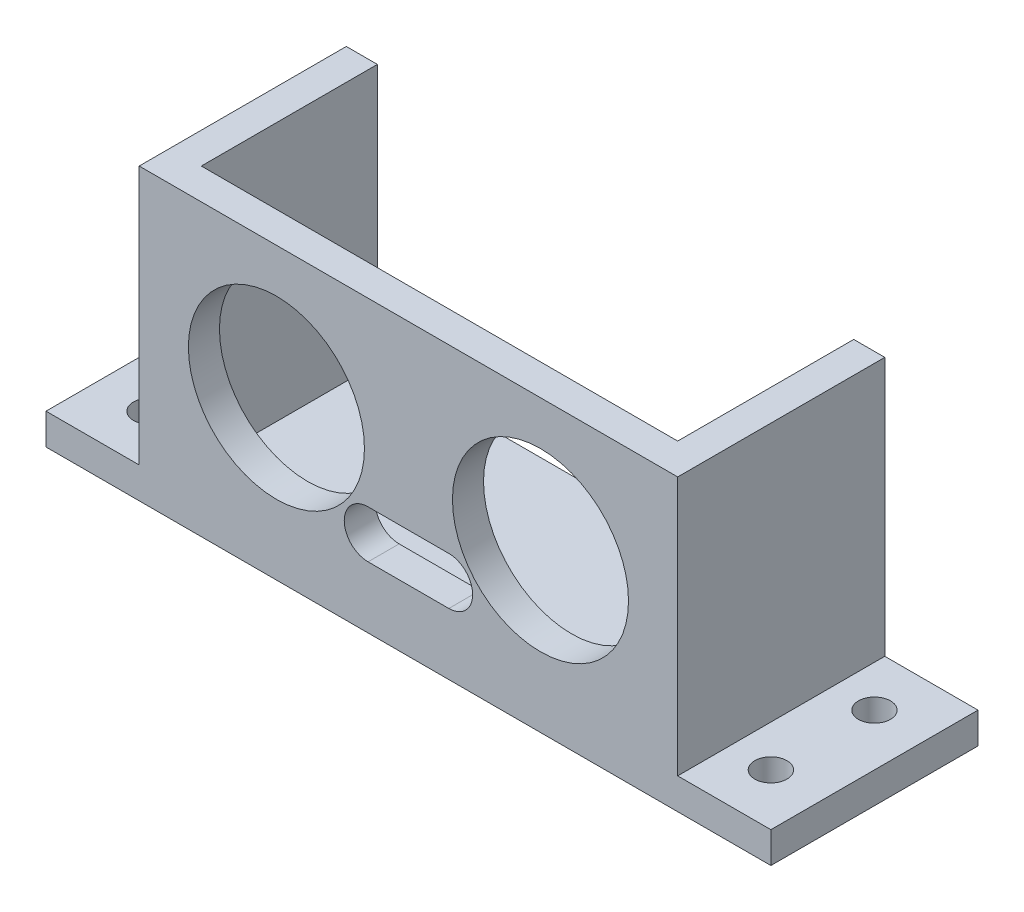
ISO-10303-21;
HEADER;
FILE_DESCRIPTION(('STEP AP214'),'2;1');
FILE_NAME('part.step','',(''),(''),'','','');
FILE_SCHEMA(('AUTOMOTIVE_DESIGN { 1 0 10303 214 1 1 1 1 }'));
ENDSEC;
DATA;
#1=APPLICATION_CONTEXT('core data for automotive mechanical design processes');
#2=APPLICATION_PROTOCOL_DEFINITION('international standard','automotive_design',2000,#1);
#3=PRODUCT_CONTEXT('',#1,'mechanical');
#4=PRODUCT('Part','Part','',(#3));
#5=PRODUCT_RELATED_PRODUCT_CATEGORY('part','',(#4));
#6=PRODUCT_DEFINITION_FORMATION('','',#4);
#7=PRODUCT_DEFINITION_CONTEXT('part definition',#1,'design');
#8=PRODUCT_DEFINITION('design','',#6,#7);
#9=PRODUCT_DEFINITION_SHAPE('','',#8);
#10=(LENGTH_UNIT() NAMED_UNIT(*) SI_UNIT(.MILLI.,.METRE.));
#11=(NAMED_UNIT(*) PLANE_ANGLE_UNIT() SI_UNIT($,.RADIAN.));
#12=(NAMED_UNIT(*) SI_UNIT($,.STERADIAN.) SOLID_ANGLE_UNIT());
#13=UNCERTAINTY_MEASURE_WITH_UNIT(LENGTH_MEASURE(1.E-05),#10,'distance_accuracy_value','');
#14=(GEOMETRIC_REPRESENTATION_CONTEXT(3) GLOBAL_UNCERTAINTY_ASSIGNED_CONTEXT((#13)) GLOBAL_UNIT_ASSIGNED_CONTEXT((#10,
#11,#12)) REPRESENTATION_CONTEXT('',''));
#15=CARTESIAN_POINT('',(0.,0.,0.));
#16=DIRECTION('',(0.,0.,1.));
#17=DIRECTION('',(1.,0.,0.));
#18=AXIS2_PLACEMENT_3D('',#15,#16,#17);
#19=CARTESIAN_POINT('',(0.,3.,0.));
#20=DIRECTION('',(0.,-1.,0.));
#21=DIRECTION('',(0.,0.,-1.));
#22=AXIS2_PLACEMENT_3D('',#19,#20,#21);
#23=PLANE('',#22);
#24=CARTESIAN_POINT('',(-30.,3.,-5.));
#25=DIRECTION('',(0.,1.,0.));
#26=DIRECTION('',(0.,0.,-1.));
#27=AXIS2_PLACEMENT_3D('',#24,#25,#26);
#28=CIRCLE('',#27,1.55);
#29=CARTESIAN_POINT('',(-30.,3.,-6.55));
#30=VERTEX_POINT('',#29);
#31=EDGE_CURVE('E291',#30,#30,#28,.T.);
#32=ORIENTED_EDGE('',*,*,#31,.F.);
#33=EDGE_LOOP('',(#32));
#34=FACE_BOUND('',#33,.T.);
#35=CARTESIAN_POINT('',(-30.,3.,5.));
#36=DIRECTION('',(0.,1.,0.));
#37=DIRECTION('',(0.,0.,1.));
#38=AXIS2_PLACEMENT_3D('',#35,#36,#37);
#39=CIRCLE('',#38,1.55);
#40=CARTESIAN_POINT('',(-30.,3.,6.55));
#41=VERTEX_POINT('',#40);
#42=EDGE_CURVE('E315',#41,#41,#39,.T.);
#43=ORIENTED_EDGE('',*,*,#42,.F.);
#44=EDGE_LOOP('',(#43));
#45=FACE_BOUND('',#44,.T.);
#46=DIRECTION('',(0.,0.,1.));
#47=VECTOR('',#46,1.);
#48=CARTESIAN_POINT('',(-26.,3.,0.));
#49=LINE('',#48,#47);
#50=CARTESIAN_POINT('',(-26.,3.,-10.));
#51=VERTEX_POINT('',#50);
#52=CARTESIAN_POINT('',(-26.,3.,10.));
#53=VERTEX_POINT('',#52);
#54=EDGE_CURVE('E216',#51,#53,#49,.T.);
#55=ORIENTED_EDGE('',*,*,#54,.F.);
#56=DIRECTION('',(-1.,0.,0.));
#57=VECTOR('',#56,1.);
#58=CARTESIAN_POINT('',(-35.,3.,-10.));
#59=LINE('',#58,#57);
#60=CARTESIAN_POINT('',(-35.,3.,-10.));
#61=VERTEX_POINT('',#60);
#62=EDGE_CURVE('E327',#51,#61,#59,.T.);
#63=ORIENTED_EDGE('',*,*,#62,.T.);
#64=DIRECTION('',(0.,0.,1.));
#65=VECTOR('',#64,1.);
#66=CARTESIAN_POINT('',(-35.,3.,10.));
#67=LINE('',#66,#65);
#68=CARTESIAN_POINT('',(-35.,3.,10.));
#69=VERTEX_POINT('',#68);
#70=EDGE_CURVE('E333',#61,#69,#67,.T.);
#71=ORIENTED_EDGE('',*,*,#70,.T.);
#72=DIRECTION('',(1.,0.,0.));
#73=VECTOR('',#72,1.);
#74=CARTESIAN_POINT('',(-35.,3.,10.));
#75=LINE('',#74,#73);
#76=EDGE_CURVE('E338',#69,#53,#75,.T.);
#77=ORIENTED_EDGE('',*,*,#76,.T.);
#78=EDGE_LOOP('',(#55,#63,#71,#77));
#79=FACE_BOUND('',#78,.T.);
#80=ADVANCED_FACE('F41',(#34,#45,#79),#23,.F.);
#81=CARTESIAN_POINT('',(23.,3.,-10.));
#82=VERTEX_POINT('',#81);
#83=CARTESIAN_POINT('',(-23.,3.,-10.));
#84=VERTEX_POINT('',#83);
#85=EDGE_CURVE('E334',#82,#84,#59,.T.);
#86=ORIENTED_EDGE('',*,*,#85,.T.);
#87=DIRECTION('',(0.,0.,1.));
#88=VECTOR('',#87,1.);
#89=CARTESIAN_POINT('',(-23.,3.,0.));
#90=LINE('',#89,#88);
#91=CARTESIAN_POINT('',(-23.,3.,7.00000000000001));
#92=VERTEX_POINT('',#91);
#93=EDGE_CURVE('E225',#84,#92,#90,.T.);
#94=ORIENTED_EDGE('',*,*,#93,.T.);
#95=DIRECTION('',(-1.,0.,0.));
#96=VECTOR('',#95,1.);
#97=CARTESIAN_POINT('',(0.,3.,7.));
#98=LINE('',#97,#96);
#99=CARTESIAN_POINT('',(23.,3.,7.));
#100=VERTEX_POINT('',#99);
#101=EDGE_CURVE('E259',#100,#92,#98,.T.);
#102=ORIENTED_EDGE('',*,*,#101,.F.);
#103=DIRECTION('',(0.,0.,1.));
#104=VECTOR('',#103,1.);
#105=CARTESIAN_POINT('',(23.,3.,0.));
#106=LINE('',#105,#104);
#107=EDGE_CURVE('E256',#82,#100,#106,.T.);
#108=ORIENTED_EDGE('',*,*,#107,.F.);
#109=EDGE_LOOP('',(#86,#94,#102,#108));
#110=FACE_BOUND('',#109,.T.);
#111=ADVANCED_FACE('F416',(#110),#23,.F.);
#112=CARTESIAN_POINT('',(35.,3.,-10.));
#113=VERTEX_POINT('',#112);
#114=CARTESIAN_POINT('',(26.,3.,-10.));
#115=VERTEX_POINT('',#114);
#116=EDGE_CURVE('E329',#113,#115,#59,.T.);
#117=ORIENTED_EDGE('',*,*,#116,.T.);
#118=DIRECTION('',(0.,0.,1.));
#119=VECTOR('',#118,1.);
#120=CARTESIAN_POINT('',(26.,3.,0.));
#121=LINE('',#120,#119);
#122=CARTESIAN_POINT('',(26.,3.,10.));
#123=VERTEX_POINT('',#122);
#124=EDGE_CURVE('E252',#115,#123,#121,.T.);
#125=ORIENTED_EDGE('',*,*,#124,.T.);
#126=CARTESIAN_POINT('',(35.,3.,10.));
#127=VERTEX_POINT('',#126);
#128=EDGE_CURVE('E337',#123,#127,#75,.T.);
#129=ORIENTED_EDGE('',*,*,#128,.T.);
#130=DIRECTION('',(0.,0.,-1.));
#131=VECTOR('',#130,1.);
#132=CARTESIAN_POINT('',(35.,3.,10.));
#133=LINE('',#132,#131);
#134=EDGE_CURVE('E323',#127,#113,#133,.T.);
#135=ORIENTED_EDGE('',*,*,#134,.T.);
#136=EDGE_LOOP('',(#117,#125,#129,#135));
#137=FACE_BOUND('',#136,.T.);
#138=CARTESIAN_POINT('',(30.,3.,4.99999999999999));
#139=DIRECTION('',(0.,1.,0.));
#140=DIRECTION('',(0.,0.,-1.));
#141=AXIS2_PLACEMENT_3D('',#138,#139,#140);
#142=CIRCLE('',#141,1.55);
#143=CARTESIAN_POINT('',(30.,3.,3.45));
#144=VERTEX_POINT('',#143);
#145=EDGE_CURVE('E307',#144,#144,#142,.T.);
#146=ORIENTED_EDGE('',*,*,#145,.F.);
#147=EDGE_LOOP('',(#146));
#148=FACE_BOUND('',#147,.T.);
#149=CARTESIAN_POINT('',(30.,3.,-4.99999999999999));
#150=DIRECTION('',(0.,1.,0.));
#151=DIRECTION('',(0.,0.,1.));
#152=AXIS2_PLACEMENT_3D('',#149,#150,#151);
#153=CIRCLE('',#152,1.55);
#154=CARTESIAN_POINT('',(30.,3.,-3.45));
#155=VERTEX_POINT('',#154);
#156=EDGE_CURVE('E299',#155,#155,#153,.T.);
#157=ORIENTED_EDGE('',*,*,#156,.F.);
#158=EDGE_LOOP('',(#157));
#159=FACE_BOUND('',#158,.T.);
#160=ADVANCED_FACE('F384',(#137,#148,#159),#23,.F.);
#161=CARTESIAN_POINT('',(0.,0.,0.));
#162=DIRECTION('',(0.,-1.,0.));
#163=DIRECTION('',(0.,0.,-1.));
#164=AXIS2_PLACEMENT_3D('',#161,#162,#163);
#165=PLANE('',#164);
#166=CARTESIAN_POINT('',(30.,0.,-4.99999999999999));
#167=DIRECTION('',(0.,1.,0.));
#168=DIRECTION('',(0.,0.,1.));
#169=AXIS2_PLACEMENT_3D('',#166,#167,#168);
#170=CIRCLE('',#169,1.55);
#171=CARTESIAN_POINT('',(30.,0.,-3.45));
#172=VERTEX_POINT('',#171);
#173=EDGE_CURVE('E295',#172,#172,#170,.T.);
#174=ORIENTED_EDGE('',*,*,#173,.T.);
#175=EDGE_LOOP('',(#174));
#176=FACE_BOUND('',#175,.T.);
#177=CARTESIAN_POINT('',(-30.,0.,5.));
#178=DIRECTION('',(0.,1.,0.));
#179=DIRECTION('',(0.,0.,1.));
#180=AXIS2_PLACEMENT_3D('',#177,#178,#179);
#181=CIRCLE('',#180,1.55);
#182=CARTESIAN_POINT('',(-30.,0.,6.55));
#183=VERTEX_POINT('',#182);
#184=EDGE_CURVE('E311',#183,#183,#181,.T.);
#185=ORIENTED_EDGE('',*,*,#184,.T.);
#186=EDGE_LOOP('',(#185));
#187=FACE_BOUND('',#186,.T.);
#188=DIRECTION('',(0.,0.,-1.));
#189=VECTOR('',#188,1.);
#190=CARTESIAN_POINT('',(35.,0.,10.));
#191=LINE('',#190,#189);
#192=CARTESIAN_POINT('',(35.,0.,10.));
#193=VERTEX_POINT('',#192);
#194=CARTESIAN_POINT('',(35.,0.,-10.));
#195=VERTEX_POINT('',#194);
#196=EDGE_CURVE('E319',#193,#195,#191,.T.);
#197=ORIENTED_EDGE('',*,*,#196,.F.);
#198=DIRECTION('',(1.,0.,0.));
#199=VECTOR('',#198,1.);
#200=CARTESIAN_POINT('',(-35.,0.,10.));
#201=LINE('',#200,#199);
#202=CARTESIAN_POINT('',(-35.,0.,10.));
#203=VERTEX_POINT('',#202);
#204=EDGE_CURVE('E328',#203,#193,#201,.T.);
#205=ORIENTED_EDGE('',*,*,#204,.F.);
#206=DIRECTION('',(0.,0.,1.));
#207=VECTOR('',#206,1.);
#208=CARTESIAN_POINT('',(-35.,0.,10.));
#209=LINE('',#208,#207);
#210=CARTESIAN_POINT('',(-35.,0.,-10.));
#211=VERTEX_POINT('',#210);
#212=EDGE_CURVE('E349',#211,#203,#209,.T.);
#213=ORIENTED_EDGE('',*,*,#212,.F.);
#214=DIRECTION('',(-1.,0.,0.));
#215=VECTOR('',#214,1.);
#216=CARTESIAN_POINT('',(-35.,0.,-10.));
#217=LINE('',#216,#215);
#218=EDGE_CURVE('E346',#195,#211,#217,.T.);
#219=ORIENTED_EDGE('',*,*,#218,.F.);
#220=EDGE_LOOP('',(#197,#205,#213,#219));
#221=FACE_BOUND('',#220,.T.);
#222=CARTESIAN_POINT('',(30.,0.,4.99999999999999));
#223=DIRECTION('',(0.,1.,0.));
#224=DIRECTION('',(0.,0.,-1.));
#225=AXIS2_PLACEMENT_3D('',#222,#223,#224);
#226=CIRCLE('',#225,1.55);
#227=CARTESIAN_POINT('',(30.,0.,3.45));
#228=VERTEX_POINT('',#227);
#229=EDGE_CURVE('E303',#228,#228,#226,.T.);
#230=ORIENTED_EDGE('',*,*,#229,.T.);
#231=EDGE_LOOP('',(#230));
#232=FACE_BOUND('',#231,.T.);
#233=CARTESIAN_POINT('',(-30.,0.,-5.));
#234=DIRECTION('',(0.,1.,0.));
#235=DIRECTION('',(0.,0.,-1.));
#236=AXIS2_PLACEMENT_3D('',#233,#234,#235);
#237=CIRCLE('',#236,1.55);
#238=CARTESIAN_POINT('',(-30.,0.,-6.55));
#239=VERTEX_POINT('',#238);
#240=EDGE_CURVE('E290',#239,#239,#237,.T.);
#241=ORIENTED_EDGE('',*,*,#240,.T.);
#242=EDGE_LOOP('',(#241));
#243=FACE_BOUND('',#242,.T.);
#244=ADVANCED_FACE('F373',(#176,#187,#221,#232,#243),#165,.T.);
#245=CARTESIAN_POINT('',(35.,3.,10.));
#246=DIRECTION('',(-1.,0.,0.));
#247=DIRECTION('',(0.,0.,1.));
#248=AXIS2_PLACEMENT_3D('',#245,#246,#247);
#249=PLANE('',#248);
#250=ORIENTED_EDGE('',*,*,#196,.T.);
#251=DIRECTION('',(0.,-1.,0.));
#252=VECTOR('',#251,1.);
#253=CARTESIAN_POINT('',(35.,3.,-10.));
#254=LINE('',#253,#252);
#255=EDGE_CURVE('E11',#113,#195,#254,.T.);
#256=ORIENTED_EDGE('',*,*,#255,.F.);
#257=ORIENTED_EDGE('',*,*,#134,.F.);
#258=DIRECTION('',(0.,-1.,0.));
#259=VECTOR('',#258,1.);
#260=CARTESIAN_POINT('',(35.,3.,10.));
#261=LINE('',#260,#259);
#262=EDGE_CURVE('E342',#127,#193,#261,.T.);
#263=ORIENTED_EDGE('',*,*,#262,.T.);
#264=EDGE_LOOP('',(#250,#256,#257,#263));
#265=FACE_BOUND('',#264,.T.);
#266=ADVANCED_FACE('F43',(#265),#249,.F.);
#267=CARTESIAN_POINT('',(-35.,3.,-10.));
#268=DIRECTION('',(0.,0.,1.));
#269=DIRECTION('',(1.,0.,0.));
#270=AXIS2_PLACEMENT_3D('',#267,#268,#269);
#271=PLANE('',#270);
#272=ORIENTED_EDGE('',*,*,#218,.T.);
#273=DIRECTION('',(0.,-1.,0.));
#274=VECTOR('',#273,1.);
#275=CARTESIAN_POINT('',(-35.,3.,-10.));
#276=LINE('',#275,#274);
#277=EDGE_CURVE('E50',#61,#211,#276,.T.);
#278=ORIENTED_EDGE('',*,*,#277,.F.);
#279=ORIENTED_EDGE('',*,*,#62,.F.);
#280=DIRECTION('',(0.,-1.,0.));
#281=VECTOR('',#280,1.);
#282=CARTESIAN_POINT('',(-26.,28.,-10.));
#283=LINE('',#282,#281);
#284=CARTESIAN_POINT('',(-26.,28.,-10.));
#285=VERTEX_POINT('',#284);
#286=EDGE_CURVE('E248',#285,#51,#283,.T.);
#287=ORIENTED_EDGE('',*,*,#286,.F.);
#288=DIRECTION('',(-1.,0.,0.));
#289=VECTOR('',#288,1.);
#290=CARTESIAN_POINT('',(0.,28.,-10.));
#291=LINE('',#290,#289);
#292=CARTESIAN_POINT('',(-23.,28.,-10.));
#293=VERTEX_POINT('',#292);
#294=EDGE_CURVE('E245',#293,#285,#291,.T.);
#295=ORIENTED_EDGE('',*,*,#294,.F.);
#296=DIRECTION('',(0.,-1.,0.));
#297=VECTOR('',#296,1.);
#298=CARTESIAN_POINT('',(-23.,28.,-10.));
#299=LINE('',#298,#297);
#300=EDGE_CURVE('E268',#293,#84,#299,.T.);
#301=ORIENTED_EDGE('',*,*,#300,.T.);
#302=ORIENTED_EDGE('',*,*,#85,.F.);
#303=DIRECTION('',(0.,-1.,0.));
#304=VECTOR('',#303,1.);
#305=CARTESIAN_POINT('',(23.,28.,-10.));
#306=LINE('',#305,#304);
#307=CARTESIAN_POINT('',(23.,28.,-10.));
#308=VERTEX_POINT('',#307);
#309=EDGE_CURVE('E278',#308,#82,#306,.T.);
#310=ORIENTED_EDGE('',*,*,#309,.F.);
#311=DIRECTION('',(-1.,0.,0.));
#312=VECTOR('',#311,1.);
#313=CARTESIAN_POINT('',(0.,28.,-10.));
#314=LINE('',#313,#312);
#315=CARTESIAN_POINT('',(26.,28.,-10.));
#316=VERTEX_POINT('',#315);
#317=EDGE_CURVE('E232',#316,#308,#314,.T.);
#318=ORIENTED_EDGE('',*,*,#317,.F.);
#319=DIRECTION('',(0.,-1.,0.));
#320=VECTOR('',#319,1.);
#321=CARTESIAN_POINT('',(26.,28.,-10.));
#322=LINE('',#321,#320);
#323=EDGE_CURVE('E281',#316,#115,#322,.T.);
#324=ORIENTED_EDGE('',*,*,#323,.T.);
#325=ORIENTED_EDGE('',*,*,#116,.F.);
#326=ORIENTED_EDGE('',*,*,#255,.T.);
#327=EDGE_LOOP('',(#272,#278,#279,#287,#295,#301,#302,#310,#318,#324,#325,#326));
#328=FACE_BOUND('',#327,.T.);
#329=ADVANCED_FACE('F395',(#328),#271,.F.);
#330=CARTESIAN_POINT('',(-35.,3.,10.));
#331=DIRECTION('',(1.,0.,0.));
#332=DIRECTION('',(0.,0.,-1.));
#333=AXIS2_PLACEMENT_3D('',#330,#331,#332);
#334=PLANE('',#333);
#335=ORIENTED_EDGE('',*,*,#212,.T.);
#336=DIRECTION('',(0.,-1.,0.));
#337=VECTOR('',#336,1.);
#338=CARTESIAN_POINT('',(-35.,3.,10.));
#339=LINE('',#338,#337);
#340=EDGE_CURVE('E357',#69,#203,#339,.T.);
#341=ORIENTED_EDGE('',*,*,#340,.F.);
#342=ORIENTED_EDGE('',*,*,#70,.F.);
#343=ORIENTED_EDGE('',*,*,#277,.T.);
#344=EDGE_LOOP('',(#335,#341,#342,#343));
#345=FACE_BOUND('',#344,.T.);
#346=ADVANCED_FACE('F366',(#345),#334,.F.);
#347=CARTESIAN_POINT('',(-35.,3.,10.));
#348=DIRECTION('',(0.,0.,-1.));
#349=DIRECTION('',(-1.,0.,0.));
#350=AXIS2_PLACEMENT_3D('',#347,#348,#349);
#351=PLANE('',#350);
#352=CARTESIAN_POINT('',(12.75,15.25,10.));
#353=DIRECTION('',(0.,0.,1.));
#354=DIRECTION('',(-1.,0.,0.));
#355=AXIS2_PLACEMENT_3D('',#352,#353,#354);
#356=CIRCLE('',#355,8.5);
#357=CARTESIAN_POINT('',(4.25000000000001,15.25,10.));
#358=VERTEX_POINT('',#357);
#359=EDGE_CURVE('E198',#358,#358,#356,.T.);
#360=ORIENTED_EDGE('',*,*,#359,.F.);
#361=EDGE_LOOP('',(#360));
#362=FACE_BOUND('',#361,.T.);
#363=DIRECTION('',(1.,0.,0.));
#364=VECTOR('',#363,1.);
#365=CARTESIAN_POINT('',(-3.9,5.95,10.));
#366=LINE('',#365,#364);
#367=CARTESIAN_POINT('',(-3.89999999999999,5.95,10.));
#368=VERTEX_POINT('',#367);
#369=CARTESIAN_POINT('',(3.9,5.95,10.));
#370=VERTEX_POINT('',#369);
#371=EDGE_CURVE('E189',#368,#370,#366,.T.);
#372=ORIENTED_EDGE('',*,*,#371,.F.);
#373=CARTESIAN_POINT('',(-3.9,8.25,10.));
#374=DIRECTION('',(0.,0.,1.));
#375=DIRECTION('',(1.,0.,0.));
#376=AXIS2_PLACEMENT_3D('',#373,#374,#375);
#377=CIRCLE('',#376,2.3);
#378=CARTESIAN_POINT('',(-3.9,10.55,10.));
#379=VERTEX_POINT('',#378);
#380=EDGE_CURVE('E57',#379,#368,#377,.T.);
#381=ORIENTED_EDGE('',*,*,#380,.F.);
#382=DIRECTION('',(-1.,0.,0.));
#383=VECTOR('',#382,1.);
#384=CARTESIAN_POINT('',(-3.9,10.55,10.));
#385=LINE('',#384,#383);
#386=CARTESIAN_POINT('',(3.9,10.55,10.));
#387=VERTEX_POINT('',#386);
#388=EDGE_CURVE('E176',#387,#379,#385,.T.);
#389=ORIENTED_EDGE('',*,*,#388,.F.);
#390=CARTESIAN_POINT('',(3.9,8.25,10.));
#391=DIRECTION('',(0.,0.,1.));
#392=DIRECTION('',(1.,0.,0.));
#393=AXIS2_PLACEMENT_3D('',#390,#391,#392);
#394=CIRCLE('',#393,2.3);
#395=EDGE_CURVE('E180',#370,#387,#394,.T.);
#396=ORIENTED_EDGE('',*,*,#395,.F.);
#397=EDGE_LOOP('',(#372,#381,#389,#396));
#398=FACE_BOUND('',#397,.T.);
#399=CARTESIAN_POINT('',(-12.75,15.25,10.));
#400=DIRECTION('',(0.,0.,1.));
#401=DIRECTION('',(1.,0.,0.));
#402=AXIS2_PLACEMENT_3D('',#399,#400,#401);
#403=CIRCLE('',#402,8.5);
#404=CARTESIAN_POINT('',(-4.25000000000001,15.25,10.));
#405=VERTEX_POINT('',#404);
#406=EDGE_CURVE('E208',#405,#405,#403,.T.);
#407=ORIENTED_EDGE('',*,*,#406,.F.);
#408=EDGE_LOOP('',(#407));
#409=FACE_BOUND('',#408,.T.);
#410=ORIENTED_EDGE('',*,*,#204,.T.);
#411=ORIENTED_EDGE('',*,*,#262,.F.);
#412=ORIENTED_EDGE('',*,*,#128,.F.);
#413=DIRECTION('',(0.,-1.,0.));
#414=VECTOR('',#413,1.);
#415=CARTESIAN_POINT('',(26.,28.,10.));
#416=LINE('',#415,#414);
#417=CARTESIAN_POINT('',(26.,28.,10.));
#418=VERTEX_POINT('',#417);
#419=EDGE_CURVE('E284',#418,#123,#416,.T.);
#420=ORIENTED_EDGE('',*,*,#419,.F.);
#421=DIRECTION('',(1.,0.,0.));
#422=VECTOR('',#421,1.);
#423=CARTESIAN_POINT('',(0.,28.,10.));
#424=LINE('',#423,#422);
#425=CARTESIAN_POINT('',(-26.,28.,10.));
#426=VERTEX_POINT('',#425);
#427=EDGE_CURVE('E224',#426,#418,#424,.T.);
#428=ORIENTED_EDGE('',*,*,#427,.F.);
#429=DIRECTION('',(0.,-1.,0.));
#430=VECTOR('',#429,1.);
#431=CARTESIAN_POINT('',(-26.,28.,10.));
#432=LINE('',#431,#430);
#433=EDGE_CURVE('E287',#426,#53,#432,.T.);
#434=ORIENTED_EDGE('',*,*,#433,.T.);
#435=ORIENTED_EDGE('',*,*,#76,.F.);
#436=ORIENTED_EDGE('',*,*,#340,.T.);
#437=EDGE_LOOP('',(#410,#411,#412,#420,#428,#434,#435,#436));
#438=FACE_BOUND('',#437,.T.);
#439=ADVANCED_FACE('F377',(#362,#398,#409,#438),#351,.F.);
#440=CARTESIAN_POINT('',(-30.,3.,5.));
#441=DIRECTION('',(0.,-1.,0.));
#442=DIRECTION('',(0.,0.,-1.));
#443=AXIS2_PLACEMENT_3D('',#440,#441,#442);
#444=CYLINDRICAL_SURFACE('',#443,1.55);
#445=ORIENTED_EDGE('',*,*,#42,.T.);
#446=EDGE_LOOP('',(#445));
#447=FACE_BOUND('',#446,.T.);
#448=ORIENTED_EDGE('',*,*,#184,.F.);
#449=EDGE_LOOP('',(#448));
#450=FACE_BOUND('',#449,.T.);
#451=ADVANCED_FACE('F454',(#447,#450),#444,.F.);
#452=CARTESIAN_POINT('',(30.,3.,4.99999999999999));
#453=DIRECTION('',(0.,-1.,0.));
#454=DIRECTION('',(0.,0.,-1.));
#455=AXIS2_PLACEMENT_3D('',#452,#453,#454);
#456=CYLINDRICAL_SURFACE('',#455,1.55);
#457=ORIENTED_EDGE('',*,*,#145,.T.);
#458=EDGE_LOOP('',(#457));
#459=FACE_BOUND('',#458,.T.);
#460=ORIENTED_EDGE('',*,*,#229,.F.);
#461=EDGE_LOOP('',(#460));
#462=FACE_BOUND('',#461,.T.);
#463=ADVANCED_FACE('F478',(#459,#462),#456,.F.);
#464=CARTESIAN_POINT('',(30.,3.,-4.99999999999999));
#465=DIRECTION('',(0.,-1.,0.));
#466=DIRECTION('',(0.,0.,-1.));
#467=AXIS2_PLACEMENT_3D('',#464,#465,#466);
#468=CYLINDRICAL_SURFACE('',#467,1.55);
#469=ORIENTED_EDGE('',*,*,#156,.T.);
#470=EDGE_LOOP('',(#469));
#471=FACE_BOUND('',#470,.T.);
#472=ORIENTED_EDGE('',*,*,#173,.F.);
#473=EDGE_LOOP('',(#472));
#474=FACE_BOUND('',#473,.T.);
#475=ADVANCED_FACE('F485',(#471,#474),#468,.F.);
#476=CARTESIAN_POINT('',(-30.,3.,-5.));
#477=DIRECTION('',(0.,-1.,0.));
#478=DIRECTION('',(0.,0.,-1.));
#479=AXIS2_PLACEMENT_3D('',#476,#477,#478);
#480=CYLINDRICAL_SURFACE('',#479,1.55);
#481=ORIENTED_EDGE('',*,*,#31,.T.);
#482=EDGE_LOOP('',(#481));
#483=FACE_BOUND('',#482,.T.);
#484=ORIENTED_EDGE('',*,*,#240,.F.);
#485=EDGE_LOOP('',(#484));
#486=FACE_BOUND('',#485,.T.);
#487=ADVANCED_FACE('F493',(#483,#486),#480,.F.);
#488=CARTESIAN_POINT('',(-26.,28.,0.));
#489=DIRECTION('',(1.,0.,0.));
#490=DIRECTION('',(0.,0.,-1.));
#491=AXIS2_PLACEMENT_3D('',#488,#489,#490);
#492=PLANE('',#491);
#493=ORIENTED_EDGE('',*,*,#54,.T.);
#494=ORIENTED_EDGE('',*,*,#433,.F.);
#495=DIRECTION('',(0.,0.,1.));
#496=VECTOR('',#495,1.);
#497=CARTESIAN_POINT('',(-26.,28.,0.));
#498=LINE('',#497,#496);
#499=EDGE_CURVE('E220',#285,#426,#498,.T.);
#500=ORIENTED_EDGE('',*,*,#499,.F.);
#501=ORIENTED_EDGE('',*,*,#286,.T.);
#502=EDGE_LOOP('',(#493,#494,#500,#501));
#503=FACE_BOUND('',#502,.T.);
#504=ADVANCED_FACE('F401',(#503),#492,.F.);
#505=CARTESIAN_POINT('',(26.,28.,0.));
#506=DIRECTION('',(1.,0.,0.));
#507=DIRECTION('',(0.,0.,-1.));
#508=AXIS2_PLACEMENT_3D('',#505,#506,#507);
#509=PLANE('',#508);
#510=ORIENTED_EDGE('',*,*,#124,.F.);
#511=ORIENTED_EDGE('',*,*,#323,.F.);
#512=DIRECTION('',(0.,0.,1.));
#513=VECTOR('',#512,1.);
#514=CARTESIAN_POINT('',(26.,28.,0.));
#515=LINE('',#514,#513);
#516=EDGE_CURVE('E228',#316,#418,#515,.T.);
#517=ORIENTED_EDGE('',*,*,#516,.T.);
#518=ORIENTED_EDGE('',*,*,#419,.T.);
#519=EDGE_LOOP('',(#510,#511,#517,#518));
#520=FACE_BOUND('',#519,.T.);
#521=ADVANCED_FACE('F430',(#520),#509,.T.);
#522=CARTESIAN_POINT('',(23.,28.,0.));
#523=DIRECTION('',(1.,0.,0.));
#524=DIRECTION('',(0.,0.,-1.));
#525=AXIS2_PLACEMENT_3D('',#522,#523,#524);
#526=PLANE('',#525);
#527=ORIENTED_EDGE('',*,*,#107,.T.);
#528=DIRECTION('',(0.,-1.,0.));
#529=VECTOR('',#528,1.);
#530=CARTESIAN_POINT('',(23.,28.,7.));
#531=LINE('',#530,#529);
#532=CARTESIAN_POINT('',(23.,28.,7.));
#533=VERTEX_POINT('',#532);
#534=EDGE_CURVE('E274',#533,#100,#531,.T.);
#535=ORIENTED_EDGE('',*,*,#534,.F.);
#536=DIRECTION('',(0.,0.,1.));
#537=VECTOR('',#536,1.);
#538=CARTESIAN_POINT('',(23.,28.,0.));
#539=LINE('',#538,#537);
#540=EDGE_CURVE('E235',#308,#533,#539,.T.);
#541=ORIENTED_EDGE('',*,*,#540,.F.);
#542=ORIENTED_EDGE('',*,*,#309,.T.);
#543=EDGE_LOOP('',(#527,#535,#541,#542));
#544=FACE_BOUND('',#543,.T.);
#545=ADVANCED_FACE('F420',(#544),#526,.F.);
#546=CARTESIAN_POINT('',(0.,28.,7.));
#547=DIRECTION('',(0.,0.,1.));
#548=DIRECTION('',(1.,0.,0.));
#549=AXIS2_PLACEMENT_3D('',#546,#547,#548);
#550=PLANE('',#549);
#551=CARTESIAN_POINT('',(12.75,15.25,7.));
#552=DIRECTION('',(0.,0.,1.));
#553=DIRECTION('',(-1.,0.,0.));
#554=AXIS2_PLACEMENT_3D('',#551,#552,#553);
#555=CIRCLE('',#554,8.5);
#556=CARTESIAN_POINT('',(4.25000000000001,15.25,7.));
#557=VERTEX_POINT('',#556);
#558=EDGE_CURVE('E204',#557,#557,#555,.T.);
#559=ORIENTED_EDGE('',*,*,#558,.T.);
#560=EDGE_LOOP('',(#559));
#561=FACE_BOUND('',#560,.T.);
#562=DIRECTION('',(-1.,0.,0.));
#563=VECTOR('',#562,1.);
#564=CARTESIAN_POINT('',(-3.9,10.55,7.));
#565=LINE('',#564,#563);
#566=CARTESIAN_POINT('',(3.9,10.55,7.));
#567=VERTEX_POINT('',#566);
#568=CARTESIAN_POINT('',(-3.9,10.55,7.));
#569=VERTEX_POINT('',#568);
#570=EDGE_CURVE('E164',#567,#569,#565,.T.);
#571=ORIENTED_EDGE('',*,*,#570,.T.);
#572=CARTESIAN_POINT('',(-3.9,8.25,7.));
#573=DIRECTION('',(0.,0.,1.));
#574=DIRECTION('',(1.,0.,0.));
#575=AXIS2_PLACEMENT_3D('',#572,#573,#574);
#576=CIRCLE('',#575,2.3);
#577=CARTESIAN_POINT('',(-3.9,5.95,7.));
#578=VERTEX_POINT('',#577);
#579=EDGE_CURVE('E157',#569,#578,#576,.T.);
#580=ORIENTED_EDGE('',*,*,#579,.T.);
#581=DIRECTION('',(1.,0.,0.));
#582=VECTOR('',#581,1.);
#583=CARTESIAN_POINT('',(-3.9,5.95,7.));
#584=LINE('',#583,#582);
#585=CARTESIAN_POINT('',(3.9,5.95,7.));
#586=VERTEX_POINT('',#585);
#587=EDGE_CURVE('E167',#578,#586,#584,.T.);
#588=ORIENTED_EDGE('',*,*,#587,.T.);
#589=CARTESIAN_POINT('',(3.9,8.25,7.));
#590=DIRECTION('',(0.,0.,1.));
#591=DIRECTION('',(1.,0.,0.));
#592=AXIS2_PLACEMENT_3D('',#589,#590,#591);
#593=CIRCLE('',#592,2.3);
#594=EDGE_CURVE('E65',#586,#567,#593,.T.);
#595=ORIENTED_EDGE('',*,*,#594,.T.);
#596=EDGE_LOOP('',(#571,#580,#588,#595));
#597=FACE_BOUND('',#596,.T.);
#598=CARTESIAN_POINT('',(-12.75,15.25,7.));
#599=DIRECTION('',(0.,0.,1.));
#600=DIRECTION('',(1.,0.,0.));
#601=AXIS2_PLACEMENT_3D('',#598,#599,#600);
#602=CIRCLE('',#601,8.5);
#603=CARTESIAN_POINT('',(-4.25000000000001,15.25,7.));
#604=VERTEX_POINT('',#603);
#605=EDGE_CURVE('E212',#604,#604,#602,.T.);
#606=ORIENTED_EDGE('',*,*,#605,.T.);
#607=EDGE_LOOP('',(#606));
#608=FACE_BOUND('',#607,.T.);
#609=ORIENTED_EDGE('',*,*,#101,.T.);
#610=DIRECTION('',(0.,-1.,0.));
#611=VECTOR('',#610,1.);
#612=CARTESIAN_POINT('',(-23.,28.,7.00000000000001));
#613=LINE('',#612,#611);
#614=CARTESIAN_POINT('',(-23.,28.,7.00000000000001));
#615=VERTEX_POINT('',#614);
#616=EDGE_CURVE('E271',#615,#92,#613,.T.);
#617=ORIENTED_EDGE('',*,*,#616,.F.);
#618=DIRECTION('',(-1.,0.,0.));
#619=VECTOR('',#618,1.);
#620=CARTESIAN_POINT('',(0.,28.,7.));
#621=LINE('',#620,#619);
#622=EDGE_CURVE('E238',#533,#615,#621,.T.);
#623=ORIENTED_EDGE('',*,*,#622,.F.);
#624=ORIENTED_EDGE('',*,*,#534,.T.);
#625=EDGE_LOOP('',(#609,#617,#623,#624));
#626=FACE_BOUND('',#625,.T.);
#627=ADVANCED_FACE('F172',(#561,#597,#608,#626),#550,.F.);
#628=CARTESIAN_POINT('',(-23.,28.,0.));
#629=DIRECTION('',(1.,0.,0.));
#630=DIRECTION('',(0.,0.,-1.));
#631=AXIS2_PLACEMENT_3D('',#628,#629,#630);
#632=PLANE('',#631);
#633=ORIENTED_EDGE('',*,*,#93,.F.);
#634=ORIENTED_EDGE('',*,*,#300,.F.);
#635=DIRECTION('',(0.,0.,1.));
#636=VECTOR('',#635,1.);
#637=CARTESIAN_POINT('',(-23.,28.,0.));
#638=LINE('',#637,#636);
#639=EDGE_CURVE('E241',#293,#615,#638,.T.);
#640=ORIENTED_EDGE('',*,*,#639,.T.);
#641=ORIENTED_EDGE('',*,*,#616,.T.);
#642=EDGE_LOOP('',(#633,#634,#640,#641));
#643=FACE_BOUND('',#642,.T.);
#644=ADVANCED_FACE('F409',(#643),#632,.T.);
#645=CARTESIAN_POINT('',(0.,28.,0.));
#646=DIRECTION('',(0.,1.,0.));
#647=DIRECTION('',(0.,0.,1.));
#648=AXIS2_PLACEMENT_3D('',#645,#646,#647);
#649=PLANE('',#648);
#650=ORIENTED_EDGE('',*,*,#499,.T.);
#651=ORIENTED_EDGE('',*,*,#427,.T.);
#652=ORIENTED_EDGE('',*,*,#516,.F.);
#653=ORIENTED_EDGE('',*,*,#317,.T.);
#654=ORIENTED_EDGE('',*,*,#540,.T.);
#655=ORIENTED_EDGE('',*,*,#622,.T.);
#656=ORIENTED_EDGE('',*,*,#639,.F.);
#657=ORIENTED_EDGE('',*,*,#294,.T.);
#658=EDGE_LOOP('',(#650,#651,#652,#653,#654,#655,#656,#657));
#659=FACE_BOUND('',#658,.T.);
#660=ADVANCED_FACE('F403',(#659),#649,.T.);
#661=CARTESIAN_POINT('',(-12.75,15.25,7.));
#662=DIRECTION('',(0.,0.,1.));
#663=DIRECTION('',(1.,0.,0.));
#664=AXIS2_PLACEMENT_3D('',#661,#662,#663);
#665=CYLINDRICAL_SURFACE('',#664,8.5);
#666=ORIENTED_EDGE('',*,*,#605,.F.);
#667=EDGE_LOOP('',(#666));
#668=FACE_BOUND('',#667,.T.);
#669=ORIENTED_EDGE('',*,*,#406,.T.);
#670=EDGE_LOOP('',(#669));
#671=FACE_BOUND('',#670,.T.);
#672=ADVANCED_FACE('F533',(#668,#671),#665,.F.);
#673=CARTESIAN_POINT('',(-3.9,8.25,7.));
#674=DIRECTION('',(0.,0.,1.));
#675=DIRECTION('',(1.,0.,0.));
#676=AXIS2_PLACEMENT_3D('',#673,#674,#675);
#677=CYLINDRICAL_SURFACE('',#676,2.3);
#678=ORIENTED_EDGE('',*,*,#380,.T.);
#679=DIRECTION('',(0.,0.,1.));
#680=VECTOR('',#679,1.);
#681=CARTESIAN_POINT('',(-3.9,5.95,7.));
#682=LINE('',#681,#680);
#683=EDGE_CURVE('E153',#578,#368,#682,.T.);
#684=ORIENTED_EDGE('',*,*,#683,.F.);
#685=ORIENTED_EDGE('',*,*,#579,.F.);
#686=DIRECTION('',(0.,0.,1.));
#687=VECTOR('',#686,1.);
#688=CARTESIAN_POINT('',(-3.9,10.55,7.));
#689=LINE('',#688,#687);
#690=EDGE_CURVE('E195',#569,#379,#689,.T.);
#691=ORIENTED_EDGE('',*,*,#690,.T.);
#692=EDGE_LOOP('',(#678,#684,#685,#691));
#693=FACE_BOUND('',#692,.T.);
#694=ADVANCED_FACE('F155',(#693),#677,.F.);
#695=CARTESIAN_POINT('',(-3.9,10.55,7.));
#696=DIRECTION('',(0.,1.,0.));
#697=DIRECTION('',(0.,0.,1.));
#698=AXIS2_PLACEMENT_3D('',#695,#696,#697);
#699=PLANE('',#698);
#700=ORIENTED_EDGE('',*,*,#388,.T.);
#701=ORIENTED_EDGE('',*,*,#690,.F.);
#702=ORIENTED_EDGE('',*,*,#570,.F.);
#703=DIRECTION('',(0.,0.,1.));
#704=VECTOR('',#703,1.);
#705=CARTESIAN_POINT('',(3.9,10.55,7.));
#706=LINE('',#705,#704);
#707=EDGE_CURVE('E199',#567,#387,#706,.T.);
#708=ORIENTED_EDGE('',*,*,#707,.T.);
#709=EDGE_LOOP('',(#700,#701,#702,#708));
#710=FACE_BOUND('',#709,.T.);
#711=ADVANCED_FACE('F550',(#710),#699,.F.);
#712=CARTESIAN_POINT('',(3.9,8.25,7.));
#713=DIRECTION('',(0.,0.,1.));
#714=DIRECTION('',(1.,0.,0.));
#715=AXIS2_PLACEMENT_3D('',#712,#713,#714);
#716=CYLINDRICAL_SURFACE('',#715,2.3);
#717=ORIENTED_EDGE('',*,*,#395,.T.);
#718=ORIENTED_EDGE('',*,*,#707,.F.);
#719=ORIENTED_EDGE('',*,*,#594,.F.);
#720=DIRECTION('',(0.,0.,1.));
#721=VECTOR('',#720,1.);
#722=CARTESIAN_POINT('',(3.9,5.95,7.));
#723=LINE('',#722,#721);
#724=EDGE_CURVE('E163',#586,#370,#723,.T.);
#725=ORIENTED_EDGE('',*,*,#724,.T.);
#726=EDGE_LOOP('',(#717,#718,#719,#725));
#727=FACE_BOUND('',#726,.T.);
#728=ADVANCED_FACE('F557',(#727),#716,.F.);
#729=CARTESIAN_POINT('',(-3.9,5.95,7.));
#730=DIRECTION('',(0.,-1.,0.));
#731=DIRECTION('',(0.,0.,-1.));
#732=AXIS2_PLACEMENT_3D('',#729,#730,#731);
#733=PLANE('',#732);
#734=ORIENTED_EDGE('',*,*,#371,.T.);
#735=ORIENTED_EDGE('',*,*,#724,.F.);
#736=ORIENTED_EDGE('',*,*,#587,.F.);
#737=ORIENTED_EDGE('',*,*,#683,.T.);
#738=EDGE_LOOP('',(#734,#735,#736,#737));
#739=FACE_BOUND('',#738,.T.);
#740=ADVANCED_FACE('F168',(#739),#733,.F.);
#741=CARTESIAN_POINT('',(12.75,15.25,7.));
#742=DIRECTION('',(0.,0.,1.));
#743=DIRECTION('',(1.,0.,0.));
#744=AXIS2_PLACEMENT_3D('',#741,#742,#743);
#745=CYLINDRICAL_SURFACE('',#744,8.5);
#746=ORIENTED_EDGE('',*,*,#558,.F.);
#747=EDGE_LOOP('',(#746));
#748=FACE_BOUND('',#747,.T.);
#749=ORIENTED_EDGE('',*,*,#359,.T.);
#750=EDGE_LOOP('',(#749));
#751=FACE_BOUND('',#750,.T.);
#752=ADVANCED_FACE('F571',(#748,#751),#745,.F.);
#753=CLOSED_SHELL('',(#80,#111,#160,#244,#266,#329,#346,#439,#451,#463,#475,#487,#504,#521,#545,
#627,#644,#660,#672,#694,#711,#728,#740,#752));
#754=MANIFOLD_SOLID_BREP('B2',#753);
#755=ADVANCED_BREP_SHAPE_REPRESENTATION('',(#18,#754),#14);
#756=SHAPE_DEFINITION_REPRESENTATION(#9,#755);
ENDSEC;
END-ISO-10303-21;
